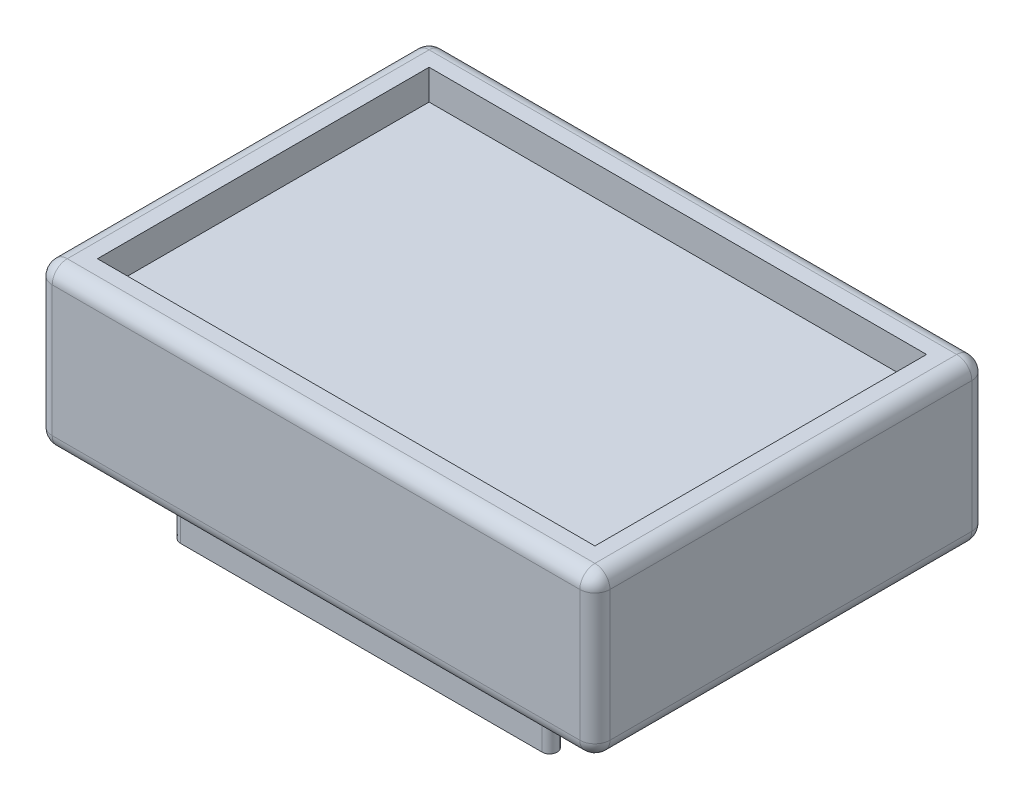
ISO-10303-21;
HEADER;
FILE_DESCRIPTION(('STEP AP214'),'2;1');
FILE_NAME('part.step','',(''),(''),'','','');
FILE_SCHEMA(('AUTOMOTIVE_DESIGN { 1 0 10303 214 1 1 1 1 }'));
ENDSEC;
DATA;
#1=APPLICATION_CONTEXT('core data for automotive mechanical design processes');
#2=APPLICATION_PROTOCOL_DEFINITION('international standard','automotive_design',2000,#1);
#3=PRODUCT_CONTEXT('',#1,'mechanical');
#4=PRODUCT('Part','Part','',(#3));
#5=PRODUCT_RELATED_PRODUCT_CATEGORY('part','',(#4));
#6=PRODUCT_DEFINITION_FORMATION('','',#4);
#7=PRODUCT_DEFINITION_CONTEXT('part definition',#1,'design');
#8=PRODUCT_DEFINITION('design','',#6,#7);
#9=PRODUCT_DEFINITION_SHAPE('','',#8);
#10=(LENGTH_UNIT() NAMED_UNIT(*) SI_UNIT(.MILLI.,.METRE.));
#11=(NAMED_UNIT(*) PLANE_ANGLE_UNIT() SI_UNIT($,.RADIAN.));
#12=(NAMED_UNIT(*) SI_UNIT($,.STERADIAN.) SOLID_ANGLE_UNIT());
#13=UNCERTAINTY_MEASURE_WITH_UNIT(LENGTH_MEASURE(1.E-05),#10,'distance_accuracy_value','');
#14=(GEOMETRIC_REPRESENTATION_CONTEXT(3) GLOBAL_UNCERTAINTY_ASSIGNED_CONTEXT((#13)) GLOBAL_UNIT_ASSIGNED_CONTEXT((#10,
#11,#12)) REPRESENTATION_CONTEXT('',''));
#15=CARTESIAN_POINT('',(0.,0.,0.));
#16=DIRECTION('',(0.,0.,1.));
#17=DIRECTION('',(1.,0.,0.));
#18=AXIS2_PLACEMENT_3D('',#15,#16,#17);
#19=CARTESIAN_POINT('',(0.,0.,0.));
#20=DIRECTION('',(0.,-1.,0.));
#21=DIRECTION('',(0.,0.,-1.));
#22=AXIS2_PLACEMENT_3D('',#19,#20,#21);
#23=PLANE('',#22);
#24=DIRECTION('',(1.,0.,0.));
#25=VECTOR('',#24,1.);
#26=CARTESIAN_POINT('',(-46.99,0.,30.48));
#27=LINE('',#26,#25);
#28=CARTESIAN_POINT('',(44.45,0.,30.48));
#29=VERTEX_POINT('',#28);
#30=CARTESIAN_POINT('',(-44.45,0.,30.48));
#31=VERTEX_POINT('',#30);
#32=EDGE_CURVE('E278',#29,#31,#27,.F.);
#33=ORIENTED_EDGE('',*,*,#32,.T.);
#34=DIRECTION('',(0.,0.,1.));
#35=VECTOR('',#34,1.);
#36=CARTESIAN_POINT('',(-44.45,0.,-33.02));
#37=LINE('',#36,#35);
#38=CARTESIAN_POINT('',(-44.45,0.,-30.48));
#39=VERTEX_POINT('',#38);
#40=EDGE_CURVE('E287',#31,#39,#37,.F.);
#41=ORIENTED_EDGE('',*,*,#40,.T.);
#42=DIRECTION('',(-1.,0.,0.));
#43=VECTOR('',#42,1.);
#44=CARTESIAN_POINT('',(46.99,0.,-30.48));
#45=LINE('',#44,#43);
#46=CARTESIAN_POINT('',(44.45,0.,-30.48));
#47=VERTEX_POINT('',#46);
#48=EDGE_CURVE('E284',#39,#47,#45,.F.);
#49=ORIENTED_EDGE('',*,*,#48,.T.);
#50=DIRECTION('',(0.,0.,-1.));
#51=VECTOR('',#50,1.);
#52=CARTESIAN_POINT('',(44.45,0.,33.02));
#53=LINE('',#52,#51);
#54=EDGE_CURVE('E281',#47,#29,#53,.F.);
#55=ORIENTED_EDGE('',*,*,#54,.T.);
#56=EDGE_LOOP('',(#33,#41,#49,#55));
#57=FACE_BOUND('',#56,.T.);
#58=DIRECTION('',(1.,0.,0.));
#59=VECTOR('',#58,1.);
#60=CARTESIAN_POINT('',(-30.48,0.,22.86));
#61=LINE('',#60,#59);
#62=CARTESIAN_POINT('',(-30.48,0.,22.86));
#63=VERTEX_POINT('',#62);
#64=CARTESIAN_POINT('',(30.48,0.,22.86));
#65=VERTEX_POINT('',#64);
#66=EDGE_CURVE('E419',#63,#65,#61,.T.);
#67=ORIENTED_EDGE('',*,*,#66,.F.);
#68=CARTESIAN_POINT('',(-30.48,0.,24.13));
#69=DIRECTION('',(0.,-1.,0.));
#70=DIRECTION('',(0.,0.,-1.));
#71=AXIS2_PLACEMENT_3D('',#68,#69,#70);
#72=CIRCLE('',#71,1.27);
#73=CARTESIAN_POINT('',(-30.48,0.,25.4));
#74=VERTEX_POINT('',#73);
#75=EDGE_CURVE('E202',#74,#63,#72,.T.);
#76=ORIENTED_EDGE('',*,*,#75,.F.);
#77=DIRECTION('',(-1.,0.,0.));
#78=VECTOR('',#77,1.);
#79=CARTESIAN_POINT('',(-30.48,0.,25.4));
#80=LINE('',#79,#78);
#81=CARTESIAN_POINT('',(30.48,0.,25.4));
#82=VERTEX_POINT('',#81);
#83=EDGE_CURVE('E198',#82,#74,#80,.T.);
#84=ORIENTED_EDGE('',*,*,#83,.F.);
#85=CARTESIAN_POINT('',(30.48,0.,24.13));
#86=DIRECTION('',(0.,-1.,0.));
#87=DIRECTION('',(0.,0.,-1.));
#88=AXIS2_PLACEMENT_3D('',#85,#86,#87);
#89=CIRCLE('',#88,1.27);
#90=EDGE_CURVE('E422',#65,#82,#89,.T.);
#91=ORIENTED_EDGE('',*,*,#90,.F.);
#92=EDGE_LOOP('',(#67,#76,#84,#91));
#93=FACE_BOUND('',#92,.T.);
#94=ADVANCED_FACE('F39',(#57,#93),#23,.T.);
#95=CARTESIAN_POINT('',(41.91,27.08,27.94));
#96=DIRECTION('',(-1.,0.,0.));
#97=DIRECTION('',(0.,0.,1.));
#98=AXIS2_PLACEMENT_3D('',#95,#96,#97);
#99=PLANE('',#98);
#100=DIRECTION('',(0.,-1.,0.));
#101=VECTOR('',#100,1.);
#102=CARTESIAN_POINT('',(41.91,27.08,-27.94));
#103=LINE('',#102,#101);
#104=CARTESIAN_POINT('',(41.91,27.08,-27.94));
#105=VERTEX_POINT('',#104);
#106=CARTESIAN_POINT('',(41.91,22.,-27.94));
#107=VERTEX_POINT('',#106);
#108=EDGE_CURVE('E248',#105,#107,#103,.T.);
#109=ORIENTED_EDGE('',*,*,#108,.T.);
#110=DIRECTION('',(0.,0.,-1.));
#111=VECTOR('',#110,1.);
#112=CARTESIAN_POINT('',(41.91,22.,27.94));
#113=LINE('',#112,#111);
#114=CARTESIAN_POINT('',(41.91,22.,27.94));
#115=VERTEX_POINT('',#114);
#116=EDGE_CURVE('E205',#115,#107,#113,.T.);
#117=ORIENTED_EDGE('',*,*,#116,.F.);
#118=DIRECTION('',(0.,-1.,0.));
#119=VECTOR('',#118,1.);
#120=CARTESIAN_POINT('',(41.91,27.08,27.94));
#121=LINE('',#120,#119);
#122=CARTESIAN_POINT('',(41.91,27.08,27.94));
#123=VERTEX_POINT('',#122);
#124=EDGE_CURVE('E236',#123,#115,#121,.T.);
#125=ORIENTED_EDGE('',*,*,#124,.F.);
#126=DIRECTION('',(0.,0.,-1.));
#127=VECTOR('',#126,1.);
#128=CARTESIAN_POINT('',(41.91,27.08,27.94));
#129=LINE('',#128,#127);
#130=EDGE_CURVE('E223',#123,#105,#129,.T.);
#131=ORIENTED_EDGE('',*,*,#130,.T.);
#132=EDGE_LOOP('',(#109,#117,#125,#131));
#133=FACE_BOUND('',#132,.T.);
#134=ADVANCED_FACE('F444',(#133),#99,.T.);
#135=CARTESIAN_POINT('',(-41.91,27.08,-27.94));
#136=DIRECTION('',(0.,0.,1.));
#137=DIRECTION('',(1.,0.,0.));
#138=AXIS2_PLACEMENT_3D('',#135,#136,#137);
#139=PLANE('',#138);
#140=DIRECTION('',(0.,-1.,0.));
#141=VECTOR('',#140,1.);
#142=CARTESIAN_POINT('',(-41.91,27.08,-27.94));
#143=LINE('',#142,#141);
#144=CARTESIAN_POINT('',(-41.91,27.08,-27.94));
#145=VERTEX_POINT('',#144);
#146=CARTESIAN_POINT('',(-41.91,22.,-27.94));
#147=VERTEX_POINT('',#146);
#148=EDGE_CURVE('E244',#145,#147,#143,.T.);
#149=ORIENTED_EDGE('',*,*,#148,.T.);
#150=DIRECTION('',(-1.,0.,0.));
#151=VECTOR('',#150,1.);
#152=CARTESIAN_POINT('',(-41.91,22.,-27.94));
#153=LINE('',#152,#151);
#154=EDGE_CURVE('E209',#107,#147,#153,.T.);
#155=ORIENTED_EDGE('',*,*,#154,.F.);
#156=ORIENTED_EDGE('',*,*,#108,.F.);
#157=DIRECTION('',(-1.,0.,0.));
#158=VECTOR('',#157,1.);
#159=CARTESIAN_POINT('',(-41.91,27.08,-27.94));
#160=LINE('',#159,#158);
#161=EDGE_CURVE('E226',#105,#145,#160,.T.);
#162=ORIENTED_EDGE('',*,*,#161,.T.);
#163=EDGE_LOOP('',(#149,#155,#156,#162));
#164=FACE_BOUND('',#163,.T.);
#165=ADVANCED_FACE('F450',(#164),#139,.T.);
#166=CARTESIAN_POINT('',(-41.91,27.08,27.94));
#167=DIRECTION('',(1.,0.,0.));
#168=DIRECTION('',(0.,0.,-1.));
#169=AXIS2_PLACEMENT_3D('',#166,#167,#168);
#170=PLANE('',#169);
#171=DIRECTION('',(0.,-1.,0.));
#172=VECTOR('',#171,1.);
#173=CARTESIAN_POINT('',(-41.91,27.08,27.94));
#174=LINE('',#173,#172);
#175=CARTESIAN_POINT('',(-41.91,27.08,27.94));
#176=VERTEX_POINT('',#175);
#177=CARTESIAN_POINT('',(-41.91,22.,27.94));
#178=VERTEX_POINT('',#177);
#179=EDGE_CURVE('E240',#176,#178,#174,.T.);
#180=ORIENTED_EDGE('',*,*,#179,.T.);
#181=DIRECTION('',(0.,0.,1.));
#182=VECTOR('',#181,1.);
#183=CARTESIAN_POINT('',(-41.91,22.,27.94));
#184=LINE('',#183,#182);
#185=EDGE_CURVE('E217',#147,#178,#184,.T.);
#186=ORIENTED_EDGE('',*,*,#185,.F.);
#187=ORIENTED_EDGE('',*,*,#148,.F.);
#188=DIRECTION('',(0.,0.,1.));
#189=VECTOR('',#188,1.);
#190=CARTESIAN_POINT('',(-41.91,27.08,27.94));
#191=LINE('',#190,#189);
#192=EDGE_CURVE('E229',#145,#176,#191,.T.);
#193=ORIENTED_EDGE('',*,*,#192,.T.);
#194=EDGE_LOOP('',(#180,#186,#187,#193));
#195=FACE_BOUND('',#194,.T.);
#196=ADVANCED_FACE('F604',(#195),#170,.T.);
#197=CARTESIAN_POINT('',(-41.91,27.08,27.94));
#198=DIRECTION('',(0.,0.,-1.));
#199=DIRECTION('',(-1.,0.,0.));
#200=AXIS2_PLACEMENT_3D('',#197,#198,#199);
#201=PLANE('',#200);
#202=ORIENTED_EDGE('',*,*,#124,.T.);
#203=DIRECTION('',(1.,0.,0.));
#204=VECTOR('',#203,1.);
#205=CARTESIAN_POINT('',(-41.91,22.,27.94));
#206=LINE('',#205,#204);
#207=EDGE_CURVE('E220',#178,#115,#206,.T.);
#208=ORIENTED_EDGE('',*,*,#207,.F.);
#209=ORIENTED_EDGE('',*,*,#179,.F.);
#210=DIRECTION('',(1.,0.,0.));
#211=VECTOR('',#210,1.);
#212=CARTESIAN_POINT('',(-41.91,27.08,27.94));
#213=LINE('',#212,#211);
#214=EDGE_CURVE('E233',#176,#123,#213,.T.);
#215=ORIENTED_EDGE('',*,*,#214,.T.);
#216=EDGE_LOOP('',(#202,#208,#209,#215));
#217=FACE_BOUND('',#216,.T.);
#218=ADVANCED_FACE('F589',(#217),#201,.T.);
#219=CARTESIAN_POINT('',(0.,27.08,0.));
#220=DIRECTION('',(0.,-1.,0.));
#221=DIRECTION('',(0.,0.,-1.));
#222=AXIS2_PLACEMENT_3D('',#219,#220,#221);
#223=PLANE('',#222);
#224=DIRECTION('',(-1.,0.,0.));
#225=VECTOR('',#224,1.);
#226=CARTESIAN_POINT('',(0.,27.08,-30.48));
#227=LINE('',#226,#225);
#228=CARTESIAN_POINT('',(44.45,27.08,-30.48));
#229=VERTEX_POINT('',#228);
#230=CARTESIAN_POINT('',(-44.45,27.08,-30.48));
#231=VERTEX_POINT('',#230);
#232=EDGE_CURVE('E258',#229,#231,#227,.T.);
#233=ORIENTED_EDGE('',*,*,#232,.T.);
#234=DIRECTION('',(0.,0.,1.));
#235=VECTOR('',#234,1.);
#236=CARTESIAN_POINT('',(-44.45,27.08,0.));
#237=LINE('',#236,#235);
#238=CARTESIAN_POINT('',(-44.45,27.08,30.48));
#239=VERTEX_POINT('',#238);
#240=EDGE_CURVE('E261',#231,#239,#237,.T.);
#241=ORIENTED_EDGE('',*,*,#240,.T.);
#242=DIRECTION('',(1.,0.,0.));
#243=VECTOR('',#242,1.);
#244=CARTESIAN_POINT('',(0.,27.08,30.48));
#245=LINE('',#244,#243);
#246=CARTESIAN_POINT('',(44.45,27.08,30.48));
#247=VERTEX_POINT('',#246);
#248=EDGE_CURVE('E252',#239,#247,#245,.T.);
#249=ORIENTED_EDGE('',*,*,#248,.T.);
#250=DIRECTION('',(0.,0.,-1.));
#251=VECTOR('',#250,1.);
#252=CARTESIAN_POINT('',(44.45,27.08,0.));
#253=LINE('',#252,#251);
#254=EDGE_CURVE('E255',#247,#229,#253,.T.);
#255=ORIENTED_EDGE('',*,*,#254,.T.);
#256=EDGE_LOOP('',(#233,#241,#249,#255));
#257=FACE_BOUND('',#256,.T.);
#258=ORIENTED_EDGE('',*,*,#130,.F.);
#259=ORIENTED_EDGE('',*,*,#214,.F.);
#260=ORIENTED_EDGE('',*,*,#192,.F.);
#261=ORIENTED_EDGE('',*,*,#161,.F.);
#262=EDGE_LOOP('',(#258,#259,#260,#261));
#263=FACE_BOUND('',#262,.T.);
#264=ADVANCED_FACE('F455',(#257,#263),#223,.F.);
#265=CARTESIAN_POINT('',(-46.99,27.08,33.02));
#266=DIRECTION('',(1.,0.,0.));
#267=DIRECTION('',(0.,0.,-1.));
#268=AXIS2_PLACEMENT_3D('',#265,#266,#267);
#269=PLANE('',#268);
#270=DIRECTION('',(0.,0.,1.));
#271=VECTOR('',#270,1.);
#272=CARTESIAN_POINT('',(-46.99,24.54,33.02));
#273=LINE('',#272,#271);
#274=CARTESIAN_POINT('',(-46.99,24.54,30.48));
#275=VERTEX_POINT('',#274);
#276=CARTESIAN_POINT('',(-46.99,24.54,-30.48));
#277=VERTEX_POINT('',#276);
#278=EDGE_CURVE('E271',#275,#277,#273,.F.);
#279=ORIENTED_EDGE('',*,*,#278,.T.);
#280=DIRECTION('',(0.,-1.,0.));
#281=VECTOR('',#280,1.);
#282=CARTESIAN_POINT('',(-46.99,27.08,-30.48));
#283=LINE('',#282,#281);
#284=CARTESIAN_POINT('',(-46.99,2.54,-30.48));
#285=VERTEX_POINT('',#284);
#286=EDGE_CURVE('E275',#277,#285,#283,.T.);
#287=ORIENTED_EDGE('',*,*,#286,.T.);
#288=DIRECTION('',(0.,0.,1.));
#289=VECTOR('',#288,1.);
#290=CARTESIAN_POINT('',(-46.99,2.54,33.02));
#291=LINE('',#290,#289);
#292=CARTESIAN_POINT('',(-46.99,2.54,30.48));
#293=VERTEX_POINT('',#292);
#294=EDGE_CURVE('E268',#285,#293,#291,.T.);
#295=ORIENTED_EDGE('',*,*,#294,.T.);
#296=DIRECTION('',(0.,-1.,0.));
#297=VECTOR('',#296,1.);
#298=CARTESIAN_POINT('',(-46.99,27.08,30.48));
#299=LINE('',#298,#297);
#300=EDGE_CURVE('E265',#293,#275,#299,.F.);
#301=ORIENTED_EDGE('',*,*,#300,.T.);
#302=EDGE_LOOP('',(#279,#287,#295,#301));
#303=FACE_BOUND('',#302,.T.);
#304=ADVANCED_FACE('F468',(#303),#269,.F.);
#305=CARTESIAN_POINT('',(-46.99,27.08,33.02));
#306=DIRECTION('',(0.,0.,-1.));
#307=DIRECTION('',(-1.,0.,0.));
#308=AXIS2_PLACEMENT_3D('',#305,#306,#307);
#309=PLANE('',#308);
#310=DIRECTION('',(1.,0.,0.));
#311=VECTOR('',#310,1.);
#312=CARTESIAN_POINT('',(-46.99,24.54,33.02));
#313=LINE('',#312,#311);
#314=CARTESIAN_POINT('',(44.45,24.54,33.02));
#315=VERTEX_POINT('',#314);
#316=CARTESIAN_POINT('',(-44.45,24.54,33.02));
#317=VERTEX_POINT('',#316);
#318=EDGE_CURVE('E49',#315,#317,#313,.F.);
#319=ORIENTED_EDGE('',*,*,#318,.T.);
#320=DIRECTION('',(0.,-1.,0.));
#321=VECTOR('',#320,1.);
#322=CARTESIAN_POINT('',(-44.45,27.08,33.02));
#323=LINE('',#322,#321);
#324=CARTESIAN_POINT('',(-44.45,2.54,33.02));
#325=VERTEX_POINT('',#324);
#326=EDGE_CURVE('E11',#317,#325,#323,.T.);
#327=ORIENTED_EDGE('',*,*,#326,.T.);
#328=DIRECTION('',(1.,0.,0.));
#329=VECTOR('',#328,1.);
#330=CARTESIAN_POINT('',(46.99,2.54,33.02));
#331=LINE('',#330,#329);
#332=CARTESIAN_POINT('',(44.45,2.54,33.02));
#333=VERTEX_POINT('',#332);
#334=EDGE_CURVE('E317',#325,#333,#331,.T.);
#335=ORIENTED_EDGE('',*,*,#334,.T.);
#336=DIRECTION('',(0.,-1.,0.));
#337=VECTOR('',#336,1.);
#338=CARTESIAN_POINT('',(44.45,27.08,33.02));
#339=LINE('',#338,#337);
#340=EDGE_CURVE('E60',#333,#315,#339,.F.);
#341=ORIENTED_EDGE('',*,*,#340,.T.);
#342=EDGE_LOOP('',(#319,#327,#335,#341));
#343=FACE_BOUND('',#342,.T.);
#344=ADVANCED_FACE('F464',(#343),#309,.F.);
#345=CARTESIAN_POINT('',(46.99,27.08,33.02));
#346=DIRECTION('',(-1.,0.,0.));
#347=DIRECTION('',(0.,0.,1.));
#348=AXIS2_PLACEMENT_3D('',#345,#346,#347);
#349=PLANE('',#348);
#350=DIRECTION('',(0.,-1.,0.));
#351=VECTOR('',#350,1.);
#352=CARTESIAN_POINT('',(46.99,27.08,-30.48));
#353=LINE('',#352,#351);
#354=CARTESIAN_POINT('',(46.99,2.54,-30.48));
#355=VERTEX_POINT('',#354);
#356=CARTESIAN_POINT('',(46.99,24.54,-30.48));
#357=VERTEX_POINT('',#356);
#358=EDGE_CURVE('E310',#355,#357,#353,.F.);
#359=ORIENTED_EDGE('',*,*,#358,.T.);
#360=DIRECTION('',(0.,0.,-1.));
#361=VECTOR('',#360,1.);
#362=CARTESIAN_POINT('',(46.99,24.54,33.02));
#363=LINE('',#362,#361);
#364=CARTESIAN_POINT('',(46.99,24.54,30.48));
#365=VERTEX_POINT('',#364);
#366=EDGE_CURVE('E313',#357,#365,#363,.F.);
#367=ORIENTED_EDGE('',*,*,#366,.T.);
#368=DIRECTION('',(0.,-1.,0.));
#369=VECTOR('',#368,1.);
#370=CARTESIAN_POINT('',(46.99,27.08,30.48));
#371=LINE('',#370,#369);
#372=CARTESIAN_POINT('',(46.99,2.54,30.48));
#373=VERTEX_POINT('',#372);
#374=EDGE_CURVE('E304',#365,#373,#371,.T.);
#375=ORIENTED_EDGE('',*,*,#374,.T.);
#376=DIRECTION('',(0.,0.,-1.));
#377=VECTOR('',#376,1.);
#378=CARTESIAN_POINT('',(46.99,2.54,-33.02));
#379=LINE('',#378,#377);
#380=EDGE_CURVE('E307',#373,#355,#379,.T.);
#381=ORIENTED_EDGE('',*,*,#380,.T.);
#382=EDGE_LOOP('',(#359,#367,#375,#381));
#383=FACE_BOUND('',#382,.T.);
#384=ADVANCED_FACE('F460',(#383),#349,.F.);
#385=CARTESIAN_POINT('',(-46.99,27.08,-33.02));
#386=DIRECTION('',(0.,0.,1.));
#387=DIRECTION('',(1.,0.,0.));
#388=AXIS2_PLACEMENT_3D('',#385,#386,#387);
#389=PLANE('',#388);
#390=DIRECTION('',(0.,-1.,0.));
#391=VECTOR('',#390,1.);
#392=CARTESIAN_POINT('',(-44.45,27.08,-33.02));
#393=LINE('',#392,#391);
#394=CARTESIAN_POINT('',(-44.45,2.54,-33.02));
#395=VERTEX_POINT('',#394);
#396=CARTESIAN_POINT('',(-44.45,24.54,-33.02));
#397=VERTEX_POINT('',#396);
#398=EDGE_CURVE('E297',#395,#397,#393,.F.);
#399=ORIENTED_EDGE('',*,*,#398,.T.);
#400=DIRECTION('',(-1.,0.,0.));
#401=VECTOR('',#400,1.);
#402=CARTESIAN_POINT('',(-46.99,24.54,-33.02));
#403=LINE('',#402,#401);
#404=CARTESIAN_POINT('',(44.45,24.54,-33.02));
#405=VERTEX_POINT('',#404);
#406=EDGE_CURVE('E300',#397,#405,#403,.F.);
#407=ORIENTED_EDGE('',*,*,#406,.T.);
#408=DIRECTION('',(0.,-1.,0.));
#409=VECTOR('',#408,1.);
#410=CARTESIAN_POINT('',(44.45,27.08,-33.02));
#411=LINE('',#410,#409);
#412=CARTESIAN_POINT('',(44.45,2.54,-33.02));
#413=VERTEX_POINT('',#412);
#414=EDGE_CURVE('E291',#405,#413,#411,.T.);
#415=ORIENTED_EDGE('',*,*,#414,.T.);
#416=DIRECTION('',(-1.,0.,0.));
#417=VECTOR('',#416,1.);
#418=CARTESIAN_POINT('',(-46.99,2.54,-33.02));
#419=LINE('',#418,#417);
#420=EDGE_CURVE('E294',#413,#395,#419,.T.);
#421=ORIENTED_EDGE('',*,*,#420,.T.);
#422=EDGE_LOOP('',(#399,#407,#415,#421));
#423=FACE_BOUND('',#422,.T.);
#424=ADVANCED_FACE('F456',(#423),#389,.F.);
#425=CARTESIAN_POINT('',(0.,22.,0.));
#426=DIRECTION('',(0.,-1.,0.));
#427=DIRECTION('',(0.,0.,-1.));
#428=AXIS2_PLACEMENT_3D('',#425,#426,#427);
#429=PLANE('',#428);
#430=ORIENTED_EDGE('',*,*,#116,.T.);
#431=ORIENTED_EDGE('',*,*,#154,.T.);
#432=ORIENTED_EDGE('',*,*,#185,.T.);
#433=ORIENTED_EDGE('',*,*,#207,.T.);
#434=EDGE_LOOP('',(#430,#431,#432,#433));
#435=FACE_BOUND('',#434,.T.);
#436=ADVANCED_FACE('F459',(#435),#429,.F.);
#437=CARTESIAN_POINT('',(-30.48,-10.,24.13));
#438=DIRECTION('',(0.,1.,0.));
#439=DIRECTION('',(0.,0.,1.));
#440=AXIS2_PLACEMENT_3D('',#437,#438,#439);
#441=CYLINDRICAL_SURFACE('',#440,1.27);
#442=ORIENTED_EDGE('',*,*,#75,.T.);
#443=DIRECTION('',(0.,1.,0.));
#444=VECTOR('',#443,1.);
#445=CARTESIAN_POINT('',(-30.48,-10.,22.86));
#446=LINE('',#445,#444);
#447=CARTESIAN_POINT('',(-30.48,-10.,22.86));
#448=VERTEX_POINT('',#447);
#449=EDGE_CURVE('E180',#448,#63,#446,.T.);
#450=ORIENTED_EDGE('',*,*,#449,.F.);
#451=CARTESIAN_POINT('',(-30.48,-10.,24.13));
#452=DIRECTION('',(0.,-1.,0.));
#453=DIRECTION('',(0.,0.,-1.));
#454=AXIS2_PLACEMENT_3D('',#451,#452,#453);
#455=CIRCLE('',#454,1.27);
#456=CARTESIAN_POINT('',(-30.48,-10.,25.4));
#457=VERTEX_POINT('',#456);
#458=EDGE_CURVE('E188',#457,#448,#455,.T.);
#459=ORIENTED_EDGE('',*,*,#458,.F.);
#460=DIRECTION('',(0.,1.,0.));
#461=VECTOR('',#460,1.);
#462=CARTESIAN_POINT('',(-30.48,-10.,25.4));
#463=LINE('',#462,#461);
#464=EDGE_CURVE('E432',#457,#74,#463,.T.);
#465=ORIENTED_EDGE('',*,*,#464,.T.);
#466=EDGE_LOOP('',(#442,#450,#459,#465));
#467=FACE_BOUND('',#466,.T.);
#468=ADVANCED_FACE('F200',(#467),#441,.T.);
#469=CARTESIAN_POINT('',(-30.48,-10.,22.86));
#470=DIRECTION('',(0.,0.,1.));
#471=DIRECTION('',(1.,0.,0.));
#472=AXIS2_PLACEMENT_3D('',#469,#470,#471);
#473=PLANE('',#472);
#474=ORIENTED_EDGE('',*,*,#66,.T.);
#475=DIRECTION('',(0.,1.,0.));
#476=VECTOR('',#475,1.);
#477=CARTESIAN_POINT('',(30.48,-10.,22.86));
#478=LINE('',#477,#476);
#479=CARTESIAN_POINT('',(30.48,-10.,22.86));
#480=VERTEX_POINT('',#479);
#481=EDGE_CURVE('E183',#480,#65,#478,.T.);
#482=ORIENTED_EDGE('',*,*,#481,.F.);
#483=DIRECTION('',(1.,0.,0.));
#484=VECTOR('',#483,1.);
#485=CARTESIAN_POINT('',(-30.48,-10.,22.86));
#486=LINE('',#485,#484);
#487=EDGE_CURVE('E176',#448,#480,#486,.T.);
#488=ORIENTED_EDGE('',*,*,#487,.F.);
#489=ORIENTED_EDGE('',*,*,#449,.T.);
#490=EDGE_LOOP('',(#474,#482,#488,#489));
#491=FACE_BOUND('',#490,.T.);
#492=ADVANCED_FACE('F178',(#491),#473,.F.);
#493=CARTESIAN_POINT('',(30.48,-10.,24.13));
#494=DIRECTION('',(0.,1.,0.));
#495=DIRECTION('',(0.,0.,1.));
#496=AXIS2_PLACEMENT_3D('',#493,#494,#495);
#497=CYLINDRICAL_SURFACE('',#496,1.27);
#498=ORIENTED_EDGE('',*,*,#90,.T.);
#499=DIRECTION('',(0.,1.,0.));
#500=VECTOR('',#499,1.);
#501=CARTESIAN_POINT('',(30.48,-10.,25.4));
#502=LINE('',#501,#500);
#503=CARTESIAN_POINT('',(30.48,-10.,25.4));
#504=VERTEX_POINT('',#503);
#505=EDGE_CURVE('E211',#504,#82,#502,.T.);
#506=ORIENTED_EDGE('',*,*,#505,.F.);
#507=CARTESIAN_POINT('',(30.48,-10.,24.13));
#508=DIRECTION('',(0.,-1.,0.));
#509=DIRECTION('',(0.,0.,-1.));
#510=AXIS2_PLACEMENT_3D('',#507,#508,#509);
#511=CIRCLE('',#510,1.27);
#512=EDGE_CURVE('E187',#480,#504,#511,.T.);
#513=ORIENTED_EDGE('',*,*,#512,.F.);
#514=ORIENTED_EDGE('',*,*,#481,.T.);
#515=EDGE_LOOP('',(#498,#506,#513,#514));
#516=FACE_BOUND('',#515,.T.);
#517=ADVANCED_FACE('F441',(#516),#497,.T.);
#518=CARTESIAN_POINT('',(-30.48,-10.,25.4));
#519=DIRECTION('',(0.,0.,-1.));
#520=DIRECTION('',(-1.,0.,0.));
#521=AXIS2_PLACEMENT_3D('',#518,#519,#520);
#522=PLANE('',#521);
#523=ORIENTED_EDGE('',*,*,#83,.T.);
#524=ORIENTED_EDGE('',*,*,#464,.F.);
#525=DIRECTION('',(-1.,0.,0.));
#526=VECTOR('',#525,1.);
#527=CARTESIAN_POINT('',(-30.48,-10.,25.4));
#528=LINE('',#527,#526);
#529=EDGE_CURVE('E193',#504,#457,#528,.T.);
#530=ORIENTED_EDGE('',*,*,#529,.F.);
#531=ORIENTED_EDGE('',*,*,#505,.T.);
#532=EDGE_LOOP('',(#523,#524,#530,#531));
#533=FACE_BOUND('',#532,.T.);
#534=ADVANCED_FACE('F437',(#533),#522,.F.);
#535=CARTESIAN_POINT('',(-30.48,-10.,24.13));
#536=DIRECTION('',(0.,-1.,0.));
#537=DIRECTION('',(0.,0.,-1.));
#538=AXIS2_PLACEMENT_3D('',#535,#536,#537);
#539=PLANE('',#538);
#540=ORIENTED_EDGE('',*,*,#458,.T.);
#541=ORIENTED_EDGE('',*,*,#487,.T.);
#542=ORIENTED_EDGE('',*,*,#512,.T.);
#543=ORIENTED_EDGE('',*,*,#529,.T.);
#544=EDGE_LOOP('',(#540,#541,#542,#543));
#545=FACE_BOUND('',#544,.T.);
#546=ADVANCED_FACE('F191',(#545),#539,.T.);
#547=CARTESIAN_POINT('',(44.45,2.54,33.02));
#548=DIRECTION('',(0.,0.,1.));
#549=DIRECTION('',(1.,0.,0.));
#550=AXIS2_PLACEMENT_3D('',#547,#548,#549);
#551=CYLINDRICAL_SURFACE('',#550,2.54);
#552=CARTESIAN_POINT('',(44.45,2.54,-30.48));
#553=DIRECTION('',(0.,0.,-1.));
#554=DIRECTION('',(-1.,0.,0.));
#555=AXIS2_PLACEMENT_3D('',#552,#553,#554);
#556=CIRCLE('',#555,2.54);
#557=EDGE_CURVE('E43',#355,#47,#556,.T.);
#558=ORIENTED_EDGE('',*,*,#557,.F.);
#559=ORIENTED_EDGE('',*,*,#380,.F.);
#560=CARTESIAN_POINT('',(44.45,2.54,30.48));
#561=DIRECTION('',(0.,0.,1.));
#562=DIRECTION('',(1.,0.,0.));
#563=AXIS2_PLACEMENT_3D('',#560,#561,#562);
#564=CIRCLE('',#563,2.54);
#565=EDGE_CURVE('E405',#29,#373,#564,.T.);
#566=ORIENTED_EDGE('',*,*,#565,.F.);
#567=ORIENTED_EDGE('',*,*,#54,.F.);
#568=EDGE_LOOP('',(#558,#559,#566,#567));
#569=FACE_BOUND('',#568,.T.);
#570=ADVANCED_FACE('F41',(#569),#551,.T.);
#571=CARTESIAN_POINT('',(44.45,2.54,-30.48));
#572=DIRECTION('',(0.,-1.,0.));
#573=DIRECTION('',(0.,0.,-1.));
#574=AXIS2_PLACEMENT_3D('',#571,#572,#573);
#575=SPHERICAL_SURFACE('',#574,2.54);
#576=CARTESIAN_POINT('',(44.45,2.54,-30.48));
#577=DIRECTION('',(0.,-1.,0.));
#578=DIRECTION('',(0.,0.,-1.));
#579=AXIS2_PLACEMENT_3D('',#576,#577,#578);
#580=CIRCLE('',#579,2.54);
#581=EDGE_CURVE('E398',#355,#413,#580,.F.);
#582=ORIENTED_EDGE('',*,*,#581,.F.);
#583=ORIENTED_EDGE('',*,*,#557,.T.);
#584=CARTESIAN_POINT('',(44.45,2.54,-30.48));
#585=DIRECTION('',(1.,0.,0.));
#586=DIRECTION('',(0.,0.,-1.));
#587=AXIS2_PLACEMENT_3D('',#584,#585,#586);
#588=CIRCLE('',#587,2.54);
#589=EDGE_CURVE('E402',#413,#47,#588,.F.);
#590=ORIENTED_EDGE('',*,*,#589,.F.);
#591=EDGE_LOOP('',(#582,#583,#590));
#592=FACE_BOUND('',#591,.T.);
#593=ADVANCED_FACE('F542',(#592),#575,.T.);
#594=CARTESIAN_POINT('',(44.45,2.54,30.48));
#595=DIRECTION('',(1.,0.,0.));
#596=DIRECTION('',(0.,1.,0.));
#597=AXIS2_PLACEMENT_3D('',#594,#595,#596);
#598=SPHERICAL_SURFACE('',#597,2.54);
#599=CARTESIAN_POINT('',(44.45,2.54,30.48));
#600=DIRECTION('',(1.,0.,0.));
#601=DIRECTION('',(0.,0.,-1.));
#602=AXIS2_PLACEMENT_3D('',#599,#600,#601);
#603=CIRCLE('',#602,2.54);
#604=EDGE_CURVE('E390',#29,#333,#603,.F.);
#605=ORIENTED_EDGE('',*,*,#604,.F.);
#606=ORIENTED_EDGE('',*,*,#565,.T.);
#607=CARTESIAN_POINT('',(44.45,2.54,30.48));
#608=DIRECTION('',(0.,-1.,0.));
#609=DIRECTION('',(0.,0.,-1.));
#610=AXIS2_PLACEMENT_3D('',#607,#608,#609);
#611=CIRCLE('',#610,2.54);
#612=EDGE_CURVE('E394',#333,#373,#611,.F.);
#613=ORIENTED_EDGE('',*,*,#612,.F.);
#614=EDGE_LOOP('',(#605,#606,#613));
#615=FACE_BOUND('',#614,.T.);
#616=ADVANCED_FACE('F539',(#615),#598,.T.);
#617=CARTESIAN_POINT('',(-46.99,2.54,-30.48));
#618=DIRECTION('',(1.,0.,0.));
#619=DIRECTION('',(0.,0.,-1.));
#620=AXIS2_PLACEMENT_3D('',#617,#618,#619);
#621=CYLINDRICAL_SURFACE('',#620,2.54);
#622=ORIENTED_EDGE('',*,*,#589,.T.);
#623=ORIENTED_EDGE('',*,*,#48,.F.);
#624=CARTESIAN_POINT('',(-44.45,2.54,-30.48));
#625=DIRECTION('',(-1.,0.,0.));
#626=DIRECTION('',(0.,0.,1.));
#627=AXIS2_PLACEMENT_3D('',#624,#625,#626);
#628=CIRCLE('',#627,2.54);
#629=EDGE_CURVE('E383',#395,#39,#628,.T.);
#630=ORIENTED_EDGE('',*,*,#629,.F.);
#631=ORIENTED_EDGE('',*,*,#420,.F.);
#632=EDGE_LOOP('',(#622,#623,#630,#631));
#633=FACE_BOUND('',#632,.T.);
#634=ADVANCED_FACE('F535',(#633),#621,.T.);
#635=CARTESIAN_POINT('',(44.45,27.08,-30.48));
#636=DIRECTION('',(0.,-1.,0.));
#637=DIRECTION('',(0.,0.,-1.));
#638=AXIS2_PLACEMENT_3D('',#635,#636,#637);
#639=CYLINDRICAL_SURFACE('',#638,2.54);
#640=ORIENTED_EDGE('',*,*,#581,.T.);
#641=ORIENTED_EDGE('',*,*,#414,.F.);
#642=CARTESIAN_POINT('',(44.45,24.54,-30.48));
#643=DIRECTION('',(0.,1.,0.));
#644=DIRECTION('',(0.,0.,1.));
#645=AXIS2_PLACEMENT_3D('',#642,#643,#644);
#646=CIRCLE('',#645,2.54);
#647=EDGE_CURVE('E379',#357,#405,#646,.T.);
#648=ORIENTED_EDGE('',*,*,#647,.F.);
#649=ORIENTED_EDGE('',*,*,#358,.F.);
#650=EDGE_LOOP('',(#640,#641,#648,#649));
#651=FACE_BOUND('',#650,.T.);
#652=ADVANCED_FACE('F531',(#651),#639,.T.);
#653=CARTESIAN_POINT('',(44.45,24.54,0.));
#654=DIRECTION('',(0.,0.,-1.));
#655=DIRECTION('',(-1.,0.,0.));
#656=AXIS2_PLACEMENT_3D('',#653,#654,#655);
#657=CYLINDRICAL_SURFACE('',#656,2.54);
#658=CARTESIAN_POINT('',(44.45,24.54,30.48));
#659=DIRECTION('',(0.,0.,1.));
#660=DIRECTION('',(1.,0.,0.));
#661=AXIS2_PLACEMENT_3D('',#658,#659,#660);
#662=CIRCLE('',#661,2.54);
#663=EDGE_CURVE('E371',#365,#247,#662,.T.);
#664=ORIENTED_EDGE('',*,*,#663,.F.);
#665=ORIENTED_EDGE('',*,*,#366,.F.);
#666=CARTESIAN_POINT('',(44.45,24.54,-30.48));
#667=DIRECTION('',(0.,0.,-1.));
#668=DIRECTION('',(-1.,0.,0.));
#669=AXIS2_PLACEMENT_3D('',#666,#667,#668);
#670=CIRCLE('',#669,2.54);
#671=EDGE_CURVE('E375',#229,#357,#670,.T.);
#672=ORIENTED_EDGE('',*,*,#671,.F.);
#673=ORIENTED_EDGE('',*,*,#254,.F.);
#674=EDGE_LOOP('',(#664,#665,#672,#673));
#675=FACE_BOUND('',#674,.T.);
#676=ADVANCED_FACE('F527',(#675),#657,.T.);
#677=CARTESIAN_POINT('',(44.45,27.08,30.48));
#678=DIRECTION('',(0.,-1.,0.));
#679=DIRECTION('',(0.,0.,-1.));
#680=AXIS2_PLACEMENT_3D('',#677,#678,#679);
#681=CYLINDRICAL_SURFACE('',#680,2.54);
#682=ORIENTED_EDGE('',*,*,#612,.T.);
#683=ORIENTED_EDGE('',*,*,#374,.F.);
#684=CARTESIAN_POINT('',(44.45,24.54,30.48));
#685=DIRECTION('',(0.,1.,0.));
#686=DIRECTION('',(0.,0.,1.));
#687=AXIS2_PLACEMENT_3D('',#684,#685,#686);
#688=CIRCLE('',#687,2.54);
#689=EDGE_CURVE('E368',#315,#365,#688,.T.);
#690=ORIENTED_EDGE('',*,*,#689,.F.);
#691=ORIENTED_EDGE('',*,*,#340,.F.);
#692=EDGE_LOOP('',(#682,#683,#690,#691));
#693=FACE_BOUND('',#692,.T.);
#694=ADVANCED_FACE('F523',(#693),#681,.T.);
#695=CARTESIAN_POINT('',(-46.99,2.54,30.48));
#696=DIRECTION('',(-1.,0.,0.));
#697=DIRECTION('',(0.,0.,1.));
#698=AXIS2_PLACEMENT_3D('',#695,#696,#697);
#699=CYLINDRICAL_SURFACE('',#698,2.54);
#700=ORIENTED_EDGE('',*,*,#604,.T.);
#701=ORIENTED_EDGE('',*,*,#334,.F.);
#702=CARTESIAN_POINT('',(-44.45,2.54,30.48));
#703=DIRECTION('',(-1.,0.,0.));
#704=DIRECTION('',(0.,0.,1.));
#705=AXIS2_PLACEMENT_3D('',#702,#703,#704);
#706=CIRCLE('',#705,2.54);
#707=EDGE_CURVE('E364',#31,#325,#706,.T.);
#708=ORIENTED_EDGE('',*,*,#707,.F.);
#709=ORIENTED_EDGE('',*,*,#32,.F.);
#710=EDGE_LOOP('',(#700,#701,#708,#709));
#711=FACE_BOUND('',#710,.T.);
#712=ADVANCED_FACE('F519',(#711),#699,.T.);
#713=CARTESIAN_POINT('',(-44.45,2.54,33.02));
#714=DIRECTION('',(0.,0.,-1.));
#715=DIRECTION('',(-1.,0.,0.));
#716=AXIS2_PLACEMENT_3D('',#713,#714,#715);
#717=CYLINDRICAL_SURFACE('',#716,2.54);
#718=CARTESIAN_POINT('',(-44.45,2.54,-30.48));
#719=DIRECTION('',(0.,0.,-1.));
#720=DIRECTION('',(-1.,0.,0.));
#721=AXIS2_PLACEMENT_3D('',#718,#719,#720);
#722=CIRCLE('',#721,2.54);
#723=EDGE_CURVE('E386',#39,#285,#722,.T.);
#724=ORIENTED_EDGE('',*,*,#723,.F.);
#725=ORIENTED_EDGE('',*,*,#40,.F.);
#726=CARTESIAN_POINT('',(-44.45,2.54,30.48));
#727=DIRECTION('',(0.,0.,1.));
#728=DIRECTION('',(1.,0.,0.));
#729=AXIS2_PLACEMENT_3D('',#726,#727,#728);
#730=CIRCLE('',#729,2.54);
#731=EDGE_CURVE('E360',#293,#31,#730,.T.);
#732=ORIENTED_EDGE('',*,*,#731,.F.);
#733=ORIENTED_EDGE('',*,*,#294,.F.);
#734=EDGE_LOOP('',(#724,#725,#732,#733));
#735=FACE_BOUND('',#734,.T.);
#736=ADVANCED_FACE('F515',(#735),#717,.T.);
#737=CARTESIAN_POINT('',(-44.45,2.54,-30.48));
#738=DIRECTION('',(0.,-1.,0.));
#739=DIRECTION('',(0.,0.,-1.));
#740=AXIS2_PLACEMENT_3D('',#737,#738,#739);
#741=SPHERICAL_SURFACE('',#740,2.54);
#742=ORIENTED_EDGE('',*,*,#629,.T.);
#743=ORIENTED_EDGE('',*,*,#723,.T.);
#744=CARTESIAN_POINT('',(-44.45,2.54,-30.48));
#745=DIRECTION('',(0.,-1.,0.));
#746=DIRECTION('',(0.,0.,-1.));
#747=AXIS2_PLACEMENT_3D('',#744,#745,#746);
#748=CIRCLE('',#747,2.54);
#749=EDGE_CURVE('E356',#395,#285,#748,.F.);
#750=ORIENTED_EDGE('',*,*,#749,.F.);
#751=EDGE_LOOP('',(#742,#743,#750));
#752=FACE_BOUND('',#751,.T.);
#753=ADVANCED_FACE('F511',(#752),#741,.T.);
#754=CARTESIAN_POINT('',(44.45,24.54,-30.48));
#755=DIRECTION('',(1.,0.,0.));
#756=DIRECTION('',(0.,0.,-1.));
#757=AXIS2_PLACEMENT_3D('',#754,#755,#756);
#758=SPHERICAL_SURFACE('',#757,2.54);
#759=ORIENTED_EDGE('',*,*,#671,.T.);
#760=ORIENTED_EDGE('',*,*,#647,.T.);
#761=CARTESIAN_POINT('',(44.45,24.54,-30.48));
#762=DIRECTION('',(1.,0.,0.));
#763=DIRECTION('',(0.,0.,-1.));
#764=AXIS2_PLACEMENT_3D('',#761,#762,#763);
#765=CIRCLE('',#764,2.54);
#766=EDGE_CURVE('E353',#229,#405,#765,.F.);
#767=ORIENTED_EDGE('',*,*,#766,.F.);
#768=EDGE_LOOP('',(#759,#760,#767));
#769=FACE_BOUND('',#768,.T.);
#770=ADVANCED_FACE('F507',(#769),#758,.T.);
#771=CARTESIAN_POINT('',(44.45,24.54,30.48));
#772=DIRECTION('',(1.,0.,0.));
#773=DIRECTION('',(0.,0.,-1.));
#774=AXIS2_PLACEMENT_3D('',#771,#772,#773);
#775=SPHERICAL_SURFACE('',#774,2.54);
#776=ORIENTED_EDGE('',*,*,#689,.T.);
#777=ORIENTED_EDGE('',*,*,#663,.T.);
#778=CARTESIAN_POINT('',(44.45,24.54,30.48));
#779=DIRECTION('',(1.,0.,0.));
#780=DIRECTION('',(0.,0.,-1.));
#781=AXIS2_PLACEMENT_3D('',#778,#779,#780);
#782=CIRCLE('',#781,2.54);
#783=EDGE_CURVE('E349',#315,#247,#782,.F.);
#784=ORIENTED_EDGE('',*,*,#783,.F.);
#785=EDGE_LOOP('',(#776,#777,#784));
#786=FACE_BOUND('',#785,.T.);
#787=ADVANCED_FACE('F503',(#786),#775,.T.);
#788=CARTESIAN_POINT('',(-44.45,2.54,30.48));
#789=DIRECTION('',(0.,-1.,0.));
#790=DIRECTION('',(0.,0.,-1.));
#791=AXIS2_PLACEMENT_3D('',#788,#789,#790);
#792=SPHERICAL_SURFACE('',#791,2.54);
#793=ORIENTED_EDGE('',*,*,#731,.T.);
#794=ORIENTED_EDGE('',*,*,#707,.T.);
#795=CARTESIAN_POINT('',(-44.45,2.54,30.48));
#796=DIRECTION('',(0.,-1.,0.));
#797=DIRECTION('',(0.,0.,-1.));
#798=AXIS2_PLACEMENT_3D('',#795,#796,#797);
#799=CIRCLE('',#798,2.54);
#800=EDGE_CURVE('E346',#293,#325,#799,.F.);
#801=ORIENTED_EDGE('',*,*,#800,.F.);
#802=EDGE_LOOP('',(#793,#794,#801));
#803=FACE_BOUND('',#802,.T.);
#804=ADVANCED_FACE('F499',(#803),#792,.T.);
#805=CARTESIAN_POINT('',(-44.45,27.08,-30.48));
#806=DIRECTION('',(0.,-1.,0.));
#807=DIRECTION('',(0.,0.,-1.));
#808=AXIS2_PLACEMENT_3D('',#805,#806,#807);
#809=CYLINDRICAL_SURFACE('',#808,2.54);
#810=ORIENTED_EDGE('',*,*,#749,.T.);
#811=ORIENTED_EDGE('',*,*,#286,.F.);
#812=CARTESIAN_POINT('',(-44.45,24.54,-30.48));
#813=DIRECTION('',(0.,1.,0.));
#814=DIRECTION('',(0.,0.,1.));
#815=AXIS2_PLACEMENT_3D('',#812,#813,#814);
#816=CIRCLE('',#815,2.54);
#817=EDGE_CURVE('E342',#397,#277,#816,.T.);
#818=ORIENTED_EDGE('',*,*,#817,.F.);
#819=ORIENTED_EDGE('',*,*,#398,.F.);
#820=EDGE_LOOP('',(#810,#811,#818,#819));
#821=FACE_BOUND('',#820,.T.);
#822=ADVANCED_FACE('F495',(#821),#809,.T.);
#823=CARTESIAN_POINT('',(0.,24.54,-30.48));
#824=DIRECTION('',(-1.,0.,0.));
#825=DIRECTION('',(0.,0.,1.));
#826=AXIS2_PLACEMENT_3D('',#823,#824,#825);
#827=CYLINDRICAL_SURFACE('',#826,2.54);
#828=ORIENTED_EDGE('',*,*,#766,.T.);
#829=ORIENTED_EDGE('',*,*,#406,.F.);
#830=CARTESIAN_POINT('',(-44.45,24.54,-30.48));
#831=DIRECTION('',(-1.,0.,0.));
#832=DIRECTION('',(0.,0.,1.));
#833=AXIS2_PLACEMENT_3D('',#830,#831,#832);
#834=CIRCLE('',#833,2.54);
#835=EDGE_CURVE('E338',#231,#397,#834,.T.);
#836=ORIENTED_EDGE('',*,*,#835,.F.);
#837=ORIENTED_EDGE('',*,*,#232,.F.);
#838=EDGE_LOOP('',(#828,#829,#836,#837));
#839=FACE_BOUND('',#838,.T.);
#840=ADVANCED_FACE('F491',(#839),#827,.T.);
#841=CARTESIAN_POINT('',(0.,24.54,30.48));
#842=DIRECTION('',(1.,0.,0.));
#843=DIRECTION('',(0.,0.,-1.));
#844=AXIS2_PLACEMENT_3D('',#841,#842,#843);
#845=CYLINDRICAL_SURFACE('',#844,2.54);
#846=ORIENTED_EDGE('',*,*,#783,.T.);
#847=ORIENTED_EDGE('',*,*,#248,.F.);
#848=CARTESIAN_POINT('',(-44.45,24.54,30.48));
#849=DIRECTION('',(-1.,0.,0.));
#850=DIRECTION('',(0.,0.,1.));
#851=AXIS2_PLACEMENT_3D('',#848,#849,#850);
#852=CIRCLE('',#851,2.54);
#853=EDGE_CURVE('E334',#317,#239,#852,.T.);
#854=ORIENTED_EDGE('',*,*,#853,.F.);
#855=ORIENTED_EDGE('',*,*,#318,.F.);
#856=EDGE_LOOP('',(#846,#847,#854,#855));
#857=FACE_BOUND('',#856,.T.);
#858=ADVANCED_FACE('F487',(#857),#845,.T.);
#859=CARTESIAN_POINT('',(-44.45,27.08,30.48));
#860=DIRECTION('',(0.,-1.,0.));
#861=DIRECTION('',(0.,0.,-1.));
#862=AXIS2_PLACEMENT_3D('',#859,#860,#861);
#863=CYLINDRICAL_SURFACE('',#862,2.54);
#864=ORIENTED_EDGE('',*,*,#800,.T.);
#865=ORIENTED_EDGE('',*,*,#326,.F.);
#866=CARTESIAN_POINT('',(-44.45,24.54,30.48));
#867=DIRECTION('',(0.,1.,0.));
#868=DIRECTION('',(0.,0.,1.));
#869=AXIS2_PLACEMENT_3D('',#866,#867,#868);
#870=CIRCLE('',#869,2.54);
#871=EDGE_CURVE('E330',#275,#317,#870,.T.);
#872=ORIENTED_EDGE('',*,*,#871,.F.);
#873=ORIENTED_EDGE('',*,*,#300,.F.);
#874=EDGE_LOOP('',(#864,#865,#872,#873));
#875=FACE_BOUND('',#874,.T.);
#876=ADVANCED_FACE('F483',(#875),#863,.T.);
#877=CARTESIAN_POINT('',(-44.45,24.54,-30.48));
#878=DIRECTION('',(0.,0.,-1.));
#879=DIRECTION('',(-1.,0.,0.));
#880=AXIS2_PLACEMENT_3D('',#877,#878,#879);
#881=SPHERICAL_SURFACE('',#880,2.54);
#882=ORIENTED_EDGE('',*,*,#835,.T.);
#883=ORIENTED_EDGE('',*,*,#817,.T.);
#884=CARTESIAN_POINT('',(-44.45,24.54,-30.48));
#885=DIRECTION('',(0.,0.,-1.));
#886=DIRECTION('',(-1.,0.,0.));
#887=AXIS2_PLACEMENT_3D('',#884,#885,#886);
#888=CIRCLE('',#887,2.54);
#889=EDGE_CURVE('E327',#231,#277,#888,.F.);
#890=ORIENTED_EDGE('',*,*,#889,.F.);
#891=EDGE_LOOP('',(#882,#883,#890));
#892=FACE_BOUND('',#891,.T.);
#893=ADVANCED_FACE('F479',(#892),#881,.T.);
#894=CARTESIAN_POINT('',(-44.45,24.54,30.48));
#895=DIRECTION('',(0.,0.,1.));
#896=DIRECTION('',(1.,0.,0.));
#897=AXIS2_PLACEMENT_3D('',#894,#895,#896);
#898=SPHERICAL_SURFACE('',#897,2.54);
#899=ORIENTED_EDGE('',*,*,#871,.T.);
#900=ORIENTED_EDGE('',*,*,#853,.T.);
#901=CARTESIAN_POINT('',(-44.45,24.54,30.48));
#902=DIRECTION('',(0.,0.,1.));
#903=DIRECTION('',(1.,0.,0.));
#904=AXIS2_PLACEMENT_3D('',#901,#902,#903);
#905=CIRCLE('',#904,2.54);
#906=EDGE_CURVE('E324',#275,#239,#905,.F.);
#907=ORIENTED_EDGE('',*,*,#906,.F.);
#908=EDGE_LOOP('',(#899,#900,#907));
#909=FACE_BOUND('',#908,.T.);
#910=ADVANCED_FACE('F475',(#909),#898,.T.);
#911=CARTESIAN_POINT('',(-44.45,24.54,0.));
#912=DIRECTION('',(0.,0.,1.));
#913=DIRECTION('',(1.,0.,0.));
#914=AXIS2_PLACEMENT_3D('',#911,#912,#913);
#915=CYLINDRICAL_SURFACE('',#914,2.54);
#916=ORIENTED_EDGE('',*,*,#889,.T.);
#917=ORIENTED_EDGE('',*,*,#278,.F.);
#918=ORIENTED_EDGE('',*,*,#906,.T.);
#919=ORIENTED_EDGE('',*,*,#240,.F.);
#920=EDGE_LOOP('',(#916,#917,#918,#919));
#921=FACE_BOUND('',#920,.T.);
#922=ADVANCED_FACE('F472',(#921),#915,.T.);
#923=CLOSED_SHELL('',(#94,#134,#165,#196,#218,#264,#304,#344,#384,#424,#436,#468,#492,#517,#534,
#546,#570,#593,#616,#634,#652,#676,#694,#712,#736,#753,#770,#787,#804,#822,#840,#858,#876,#893,
#910,#922));
#924=MANIFOLD_SOLID_BREP('B2',#923);
#925=ADVANCED_BREP_SHAPE_REPRESENTATION('',(#18,#924),#14);
#926=SHAPE_DEFINITION_REPRESENTATION(#9,#925);
ENDSEC;
END-ISO-10303-21;
